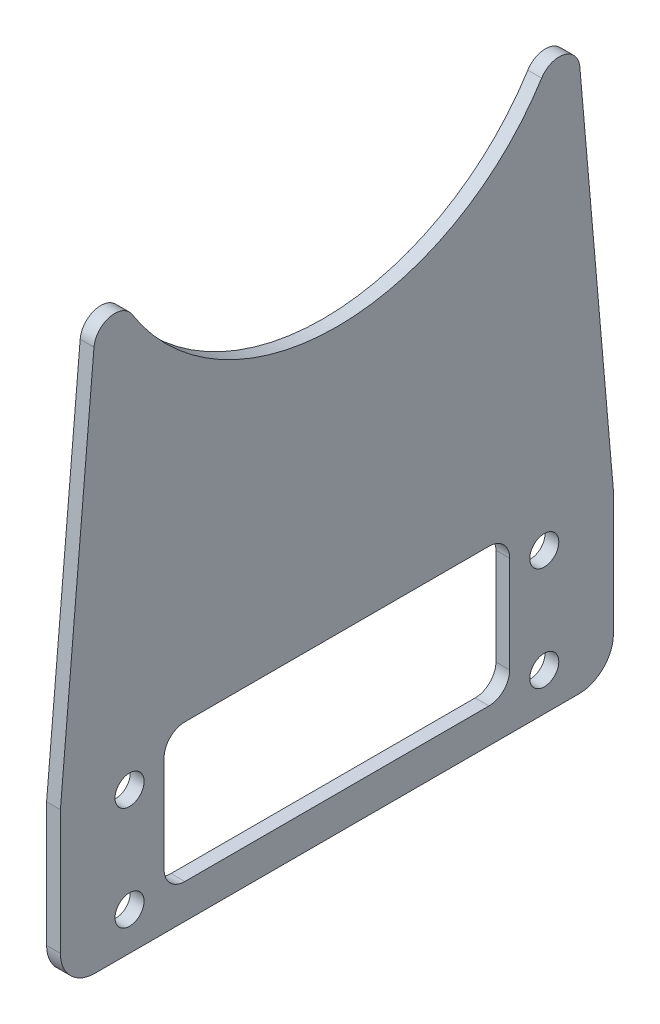
ISO-10303-21;
HEADER;
FILE_DESCRIPTION(('STEP AP214'),'2;1');
FILE_NAME('part.step','',(''),(''),'','','');
FILE_SCHEMA(('AUTOMOTIVE_DESIGN { 1 0 10303 214 1 1 1 1 }'));
ENDSEC;
DATA;
#1=APPLICATION_CONTEXT('core data for automotive mechanical design processes');
#2=APPLICATION_PROTOCOL_DEFINITION('international standard','automotive_design',2000,#1);
#3=PRODUCT_CONTEXT('',#1,'mechanical');
#4=PRODUCT('Part','Part','',(#3));
#5=PRODUCT_RELATED_PRODUCT_CATEGORY('part','',(#4));
#6=PRODUCT_DEFINITION_FORMATION('','',#4);
#7=PRODUCT_DEFINITION_CONTEXT('part definition',#1,'design');
#8=PRODUCT_DEFINITION('design','',#6,#7);
#9=PRODUCT_DEFINITION_SHAPE('','',#8);
#10=(LENGTH_UNIT() NAMED_UNIT(*) SI_UNIT(.MILLI.,.METRE.));
#11=(NAMED_UNIT(*) PLANE_ANGLE_UNIT() SI_UNIT($,.RADIAN.));
#12=(NAMED_UNIT(*) SI_UNIT($,.STERADIAN.) SOLID_ANGLE_UNIT());
#13=UNCERTAINTY_MEASURE_WITH_UNIT(LENGTH_MEASURE(1.E-05),#10,'distance_accuracy_value','');
#14=(GEOMETRIC_REPRESENTATION_CONTEXT(3) GLOBAL_UNCERTAINTY_ASSIGNED_CONTEXT((#13)) GLOBAL_UNIT_ASSIGNED_CONTEXT((#10,
#11,#12)) REPRESENTATION_CONTEXT('',''));
#15=CARTESIAN_POINT('',(0.,0.,0.));
#16=DIRECTION('',(0.,0.,1.));
#17=DIRECTION('',(1.,0.,0.));
#18=AXIS2_PLACEMENT_3D('',#15,#16,#17);
#19=CARTESIAN_POINT('',(2.,11.5,-40.));
#20=DIRECTION('',(0.,0.,1.));
#21=DIRECTION('',(0.,-1.,0.));
#22=AXIS2_PLACEMENT_3D('',#19,#20,#21);
#23=PLANE('',#22);
#24=DIRECTION('',(0.,1.,0.));
#25=VECTOR('',#24,1.);
#26=CARTESIAN_POINT('',(2.,11.5,-40.));
#27=LINE('',#26,#25);
#28=CARTESIAN_POINT('',(2.,-6.5,-40.));
#29=VERTEX_POINT('',#28);
#30=CARTESIAN_POINT('',(2.,11.5,-40.));
#31=VERTEX_POINT('',#30);
#32=EDGE_CURVE('E160',#29,#31,#27,.T.);
#33=ORIENTED_EDGE('',*,*,#32,.F.);
#34=DIRECTION('',(-1.,0.,0.));
#35=VECTOR('',#34,1.);
#36=CARTESIAN_POINT('',(2.,-6.5,-40.));
#37=LINE('',#36,#35);
#38=CARTESIAN_POINT('',(0.,-6.5,-40.));
#39=VERTEX_POINT('',#38);
#40=EDGE_CURVE('E11',#29,#39,#37,.T.);
#41=ORIENTED_EDGE('',*,*,#40,.T.);
#42=DIRECTION('',(0.,1.,0.));
#43=VECTOR('',#42,1.);
#44=CARTESIAN_POINT('',(0.,11.5,-40.));
#45=LINE('',#44,#43);
#46=CARTESIAN_POINT('',(0.,11.5,-40.));
#47=VERTEX_POINT('',#46);
#48=EDGE_CURVE('E180',#39,#47,#45,.T.);
#49=ORIENTED_EDGE('',*,*,#48,.T.);
#50=DIRECTION('',(-1.,0.,0.));
#51=VECTOR('',#50,1.);
#52=CARTESIAN_POINT('',(2.,11.5,-40.));
#53=LINE('',#52,#51);
#54=EDGE_CURVE('E174',#31,#47,#53,.T.);
#55=ORIENTED_EDGE('',*,*,#54,.F.);
#56=EDGE_LOOP('',(#33,#41,#49,#55));
#57=FACE_BOUND('',#56,.T.);
#58=ADVANCED_FACE('F34',(#57),#23,.F.);
#59=CARTESIAN_POINT('',(2.,79.0655702071974,-34.0887785622056));
#60=DIRECTION('',(0.,-0.0871557427476542,0.996194698091746));
#61=DIRECTION('',(0.,-0.996194698091746,-0.0871557427476543));
#62=AXIS2_PLACEMENT_3D('',#59,#60,#61);
#63=PLANE('',#62);
#64=DIRECTION('',(0.,0.996194698091746,0.0871557427476542));
#65=VECTOR('',#64,1.);
#66=CARTESIAN_POINT('',(0.,79.0655702071974,-34.0887785622056));
#67=LINE('',#66,#65);
#68=CARTESIAN_POINT('',(0.,67.0113184520581,-35.1433889380677));
#69=VERTEX_POINT('',#68);
#70=EDGE_CURVE('E278',#47,#69,#67,.T.);
#71=ORIENTED_EDGE('',*,*,#70,.T.);
#72=DIRECTION('',(-1.,0.,0.));
#73=VECTOR('',#72,1.);
#74=CARTESIAN_POINT('',(2.,67.0113184520581,-35.1433889380677));
#75=LINE('',#74,#73);
#76=CARTESIAN_POINT('',(2.,67.0113184520581,-35.1433889380677));
#77=VERTEX_POINT('',#76);
#78=EDGE_CURVE('E176',#69,#77,#75,.F.);
#79=ORIENTED_EDGE('',*,*,#78,.T.);
#80=DIRECTION('',(0.,0.996194698091746,0.0871557427476542));
#81=VECTOR('',#80,1.);
#82=CARTESIAN_POINT('',(2.,79.0655702071974,-34.0887785622056));
#83=LINE('',#82,#81);
#84=EDGE_CURVE('E163',#31,#77,#83,.T.);
#85=ORIENTED_EDGE('',*,*,#84,.F.);
#86=ORIENTED_EDGE('',*,*,#54,.T.);
#87=EDGE_LOOP('',(#71,#79,#85,#86));
#88=FACE_BOUND('',#87,.T.);
#89=ADVANCED_FACE('F173',(#88),#63,.F.);
#90=CARTESIAN_POINT('',(2.,87.,0.));
#91=DIRECTION('',(-1.,0.,0.));
#92=DIRECTION('',(0.,0.,1.));
#93=AXIS2_PLACEMENT_3D('',#90,#91,#92);
#94=CYLINDRICAL_SURFACE('',#93,35.);
#95=CARTESIAN_POINT('',(2.,87.,0.));
#96=DIRECTION('',(-1.,0.,0.));
#97=DIRECTION('',(0.,0.,-1.));
#98=AXIS2_PLACEMENT_3D('',#95,#96,#97);
#99=CIRCLE('',#98,35.);
#100=CARTESIAN_POINT('',(2.,68.3485471798297,-29.6162676192825));
#101=VERTEX_POINT('',#100);
#102=CARTESIAN_POINT('',(2.,68.3485471798297,29.6162676192825));
#103=VERTEX_POINT('',#102);
#104=EDGE_CURVE('E177',#101,#103,#99,.T.);
#105=ORIENTED_EDGE('',*,*,#104,.F.);
#106=DIRECTION('',(-1.,0.,0.));
#107=VECTOR('',#106,1.);
#108=CARTESIAN_POINT('',(2.,68.3485471798297,-29.6162676192825));
#109=LINE('',#108,#107);
#110=CARTESIAN_POINT('',(0.,68.3485471798297,-29.6162676192825));
#111=VERTEX_POINT('',#110);
#112=EDGE_CURVE('E211',#101,#111,#109,.T.);
#113=ORIENTED_EDGE('',*,*,#112,.T.);
#114=CARTESIAN_POINT('',(0.,87.,0.));
#115=DIRECTION('',(-1.,0.,0.));
#116=DIRECTION('',(0.,0.,-1.));
#117=AXIS2_PLACEMENT_3D('',#114,#115,#116);
#118=CIRCLE('',#117,35.);
#119=CARTESIAN_POINT('',(0.,68.3485471798297,29.6162676192825));
#120=VERTEX_POINT('',#119);
#121=EDGE_CURVE('E273',#111,#120,#118,.T.);
#122=ORIENTED_EDGE('',*,*,#121,.T.);
#123=DIRECTION('',(-1.,0.,0.));
#124=VECTOR('',#123,1.);
#125=CARTESIAN_POINT('',(2.,68.3485471798297,29.6162676192825));
#126=LINE('',#125,#124);
#127=EDGE_CURVE('E209',#120,#103,#126,.F.);
#128=ORIENTED_EDGE('',*,*,#127,.T.);
#129=EDGE_LOOP('',(#105,#113,#122,#128));
#130=FACE_BOUND('',#129,.T.);
#131=ADVANCED_FACE('F398',(#130),#94,.F.);
#132=CARTESIAN_POINT('',(2.,11.5,40.));
#133=DIRECTION('',(0.,-0.0871557427476543,-0.996194698091746));
#134=DIRECTION('',(0.,0.996194698091746,-0.0871557427476544));
#135=AXIS2_PLACEMENT_3D('',#132,#133,#134);
#136=PLANE('',#135);
#137=DIRECTION('',(0.,-0.996194698091746,0.0871557427476543));
#138=VECTOR('',#137,1.);
#139=CARTESIAN_POINT('',(2.,11.5,40.));
#140=LINE('',#139,#138);
#141=CARTESIAN_POINT('',(2.,67.0113184520581,35.1433889380677));
#142=VERTEX_POINT('',#141);
#143=CARTESIAN_POINT('',(2.,11.5,40.));
#144=VERTEX_POINT('',#143);
#145=EDGE_CURVE('E283',#142,#144,#140,.T.);
#146=ORIENTED_EDGE('',*,*,#145,.F.);
#147=DIRECTION('',(-1.,0.,0.));
#148=VECTOR('',#147,1.);
#149=CARTESIAN_POINT('',(2.,67.0113184520581,35.1433889380677));
#150=LINE('',#149,#148);
#151=CARTESIAN_POINT('',(0.,67.0113184520581,35.1433889380677));
#152=VERTEX_POINT('',#151);
#153=EDGE_CURVE('E223',#142,#152,#150,.T.);
#154=ORIENTED_EDGE('',*,*,#153,.T.);
#155=DIRECTION('',(0.,-0.996194698091746,0.0871557427476543));
#156=VECTOR('',#155,1.);
#157=CARTESIAN_POINT('',(0.,11.5,40.));
#158=LINE('',#157,#156);
#159=CARTESIAN_POINT('',(0.,11.5,40.));
#160=VERTEX_POINT('',#159);
#161=EDGE_CURVE('E271',#152,#160,#158,.T.);
#162=ORIENTED_EDGE('',*,*,#161,.T.);
#163=DIRECTION('',(-1.,0.,0.));
#164=VECTOR('',#163,1.);
#165=CARTESIAN_POINT('',(2.,11.5,40.));
#166=LINE('',#165,#164);
#167=EDGE_CURVE('E183',#144,#160,#166,.T.);
#168=ORIENTED_EDGE('',*,*,#167,.F.);
#169=EDGE_LOOP('',(#146,#154,#162,#168));
#170=FACE_BOUND('',#169,.T.);
#171=ADVANCED_FACE('F434',(#170),#136,.F.);
#172=CARTESIAN_POINT('',(2.,11.5,40.));
#173=DIRECTION('',(0.,0.,-1.));
#174=DIRECTION('',(0.,1.,0.));
#175=AXIS2_PLACEMENT_3D('',#172,#173,#174);
#176=PLANE('',#175);
#177=DIRECTION('',(0.,-1.,0.));
#178=VECTOR('',#177,1.);
#179=CARTESIAN_POINT('',(0.,11.5,40.));
#180=LINE('',#179,#178);
#181=CARTESIAN_POINT('',(0.,-6.5,40.));
#182=VERTEX_POINT('',#181);
#183=EDGE_CURVE('E268',#160,#182,#180,.T.);
#184=ORIENTED_EDGE('',*,*,#183,.T.);
#185=DIRECTION('',(-1.,0.,0.));
#186=VECTOR('',#185,1.);
#187=CARTESIAN_POINT('',(2.,-6.5,40.));
#188=LINE('',#187,#186);
#189=CARTESIAN_POINT('',(2.,-6.5,40.));
#190=VERTEX_POINT('',#189);
#191=EDGE_CURVE('E57',#182,#190,#188,.F.);
#192=ORIENTED_EDGE('',*,*,#191,.T.);
#193=DIRECTION('',(0.,-1.,0.));
#194=VECTOR('',#193,1.);
#195=CARTESIAN_POINT('',(2.,11.5,40.));
#196=LINE('',#195,#194);
#197=EDGE_CURVE('E254',#144,#190,#196,.T.);
#198=ORIENTED_EDGE('',*,*,#197,.F.);
#199=ORIENTED_EDGE('',*,*,#167,.T.);
#200=EDGE_LOOP('',(#184,#192,#198,#199));
#201=FACE_BOUND('',#200,.T.);
#202=ADVANCED_FACE('F269',(#201),#176,.F.);
#203=CARTESIAN_POINT('',(2.,-11.5,40.));
#204=DIRECTION('',(0.,1.,0.));
#205=DIRECTION('',(0.,0.,1.));
#206=AXIS2_PLACEMENT_3D('',#203,#204,#205);
#207=PLANE('',#206);
#208=DIRECTION('',(0.,0.,-1.));
#209=VECTOR('',#208,1.);
#210=CARTESIAN_POINT('',(2.,-11.5,40.));
#211=LINE('',#210,#209);
#212=CARTESIAN_POINT('',(2.,-11.5,35.));
#213=VERTEX_POINT('',#212);
#214=CARTESIAN_POINT('',(2.,-11.5,-35.));
#215=VERTEX_POINT('',#214);
#216=EDGE_CURVE('E188',#213,#215,#211,.T.);
#217=ORIENTED_EDGE('',*,*,#216,.F.);
#218=DIRECTION('',(-1.,0.,0.));
#219=VECTOR('',#218,1.);
#220=CARTESIAN_POINT('',(2.,-11.5,35.));
#221=LINE('',#220,#219);
#222=CARTESIAN_POINT('',(0.,-11.5,35.));
#223=VERTEX_POINT('',#222);
#224=EDGE_CURVE('E244',#213,#223,#221,.T.);
#225=ORIENTED_EDGE('',*,*,#224,.T.);
#226=DIRECTION('',(0.,0.,-1.));
#227=VECTOR('',#226,1.);
#228=CARTESIAN_POINT('',(0.,-11.5,40.));
#229=LINE('',#228,#227);
#230=CARTESIAN_POINT('',(0.,-11.5,-35.));
#231=VERTEX_POINT('',#230);
#232=EDGE_CURVE('E168',#223,#231,#229,.T.);
#233=ORIENTED_EDGE('',*,*,#232,.T.);
#234=DIRECTION('',(-1.,0.,0.));
#235=VECTOR('',#234,1.);
#236=CARTESIAN_POINT('',(2.,-11.5,-35.));
#237=LINE('',#236,#235);
#238=EDGE_CURVE('E242',#231,#215,#237,.F.);
#239=ORIENTED_EDGE('',*,*,#238,.T.);
#240=EDGE_LOOP('',(#217,#225,#233,#239));
#241=FACE_BOUND('',#240,.T.);
#242=ADVANCED_FACE('F258',(#241),#207,.F.);
#243=CARTESIAN_POINT('',(2.,87.,0.));
#244=DIRECTION('',(1.,0.,0.));
#245=DIRECTION('',(0.,0.,-1.));
#246=AXIS2_PLACEMENT_3D('',#243,#244,#245);
#247=PLANE('',#246);
#248=CARTESIAN_POINT('',(2.,9.,-30.));
#249=DIRECTION('',(1.,0.,0.));
#250=DIRECTION('',(0.,0.,-1.));
#251=AXIS2_PLACEMENT_3D('',#248,#249,#250);
#252=CIRCLE('',#251,2.09999999999999);
#253=CARTESIAN_POINT('',(2.,9.,-32.1));
#254=VERTEX_POINT('',#253);
#255=EDGE_CURVE('E311',#254,#254,#252,.T.);
#256=ORIENTED_EDGE('',*,*,#255,.F.);
#257=EDGE_LOOP('',(#256));
#258=FACE_BOUND('',#257,.T.);
#259=CARTESIAN_POINT('',(2.,-6.,-30.));
#260=DIRECTION('',(1.,0.,0.));
#261=DIRECTION('',(0.,0.,-1.));
#262=AXIS2_PLACEMENT_3D('',#259,#260,#261);
#263=CIRCLE('',#262,2.09999999999998);
#264=CARTESIAN_POINT('',(2.,-6.,-32.1));
#265=VERTEX_POINT('',#264);
#266=EDGE_CURVE('E317',#265,#265,#263,.T.);
#267=ORIENTED_EDGE('',*,*,#266,.F.);
#268=EDGE_LOOP('',(#267));
#269=FACE_BOUND('',#268,.T.);
#270=CARTESIAN_POINT('',(2.,-6.,30.));
#271=DIRECTION('',(1.,0.,0.));
#272=DIRECTION('',(0.,0.,-1.));
#273=AXIS2_PLACEMENT_3D('',#270,#271,#272);
#274=CIRCLE('',#273,2.1);
#275=CARTESIAN_POINT('',(2.,-6.,27.9));
#276=VERTEX_POINT('',#275);
#277=EDGE_CURVE('E323',#276,#276,#274,.T.);
#278=ORIENTED_EDGE('',*,*,#277,.F.);
#279=EDGE_LOOP('',(#278));
#280=FACE_BOUND('',#279,.T.);
#281=CARTESIAN_POINT('',(2.,9.,30.));
#282=DIRECTION('',(1.,0.,0.));
#283=DIRECTION('',(0.,0.,-1.));
#284=AXIS2_PLACEMENT_3D('',#281,#282,#283);
#285=CIRCLE('',#284,2.1);
#286=CARTESIAN_POINT('',(2.,9.,27.9));
#287=VERTEX_POINT('',#286);
#288=EDGE_CURVE('E329',#287,#287,#285,.T.);
#289=ORIENTED_EDGE('',*,*,#288,.F.);
#290=EDGE_LOOP('',(#289));
#291=FACE_BOUND('',#290,.T.);
#292=DIRECTION('',(0.,1.,0.));
#293=VECTOR('',#292,1.);
#294=CARTESIAN_POINT('',(2.,13.5,-25.));
#295=LINE('',#294,#293);
#296=CARTESIAN_POINT('',(2.,-3.5,-25.));
#297=VERTEX_POINT('',#296);
#298=CARTESIAN_POINT('',(2.,10.5,-25.));
#299=VERTEX_POINT('',#298);
#300=EDGE_CURVE('E297',#297,#299,#295,.T.);
#301=ORIENTED_EDGE('',*,*,#300,.F.);
#302=CARTESIAN_POINT('',(2.,-3.5,-22.));
#303=DIRECTION('',(1.,0.,0.));
#304=DIRECTION('',(0.,0.,-1.));
#305=AXIS2_PLACEMENT_3D('',#302,#303,#304);
#306=CIRCLE('',#305,3.);
#307=CARTESIAN_POINT('',(2.,-6.5,-22.));
#308=VERTEX_POINT('',#307);
#309=EDGE_CURVE('E234',#297,#308,#306,.F.);
#310=ORIENTED_EDGE('',*,*,#309,.T.);
#311=DIRECTION('',(0.,0.,-1.));
#312=VECTOR('',#311,1.);
#313=CARTESIAN_POINT('',(2.,-6.5,25.));
#314=LINE('',#313,#312);
#315=CARTESIAN_POINT('',(2.,-6.5,22.));
#316=VERTEX_POINT('',#315);
#317=EDGE_CURVE('E287',#316,#308,#314,.T.);
#318=ORIENTED_EDGE('',*,*,#317,.F.);
#319=CARTESIAN_POINT('',(2.,-3.5,22.));
#320=DIRECTION('',(1.,0.,0.));
#321=DIRECTION('',(0.,0.,-1.));
#322=AXIS2_PLACEMENT_3D('',#319,#320,#321);
#323=CIRCLE('',#322,3.);
#324=CARTESIAN_POINT('',(2.,-3.5,25.));
#325=VERTEX_POINT('',#324);
#326=EDGE_CURVE('E226',#316,#325,#323,.F.);
#327=ORIENTED_EDGE('',*,*,#326,.T.);
#328=DIRECTION('',(0.,-1.,0.));
#329=VECTOR('',#328,1.);
#330=CARTESIAN_POINT('',(2.,13.5,25.));
#331=LINE('',#330,#329);
#332=CARTESIAN_POINT('',(2.,10.5,25.));
#333=VERTEX_POINT('',#332);
#334=EDGE_CURVE('E291',#333,#325,#331,.T.);
#335=ORIENTED_EDGE('',*,*,#334,.F.);
#336=CARTESIAN_POINT('',(2.,10.5,22.));
#337=DIRECTION('',(1.,0.,0.));
#338=DIRECTION('',(0.,0.,-1.));
#339=AXIS2_PLACEMENT_3D('',#336,#337,#338);
#340=CIRCLE('',#339,3.);
#341=CARTESIAN_POINT('',(2.,13.5,22.));
#342=VERTEX_POINT('',#341);
#343=EDGE_CURVE('E238',#333,#342,#340,.F.);
#344=ORIENTED_EDGE('',*,*,#343,.T.);
#345=DIRECTION('',(0.,0.,1.));
#346=VECTOR('',#345,1.);
#347=CARTESIAN_POINT('',(2.,13.5,25.));
#348=LINE('',#347,#346);
#349=CARTESIAN_POINT('',(2.,13.5,-22.));
#350=VERTEX_POINT('',#349);
#351=EDGE_CURVE('E294',#350,#342,#348,.T.);
#352=ORIENTED_EDGE('',*,*,#351,.F.);
#353=CARTESIAN_POINT('',(2.,10.5,-22.));
#354=DIRECTION('',(1.,0.,0.));
#355=DIRECTION('',(0.,0.,-1.));
#356=AXIS2_PLACEMENT_3D('',#353,#354,#355);
#357=CIRCLE('',#356,3.);
#358=EDGE_CURVE('E230',#350,#299,#357,.F.);
#359=ORIENTED_EDGE('',*,*,#358,.T.);
#360=EDGE_LOOP('',(#301,#310,#318,#327,#335,#344,#352,#359));
#361=FACE_BOUND('',#360,.T.);
#362=ORIENTED_EDGE('',*,*,#197,.T.);
#363=CARTESIAN_POINT('',(2.,-6.5,35.));
#364=DIRECTION('',(1.,0.,0.));
#365=DIRECTION('',(0.,0.,-1.));
#366=AXIS2_PLACEMENT_3D('',#363,#364,#365);
#367=CIRCLE('',#366,5.);
#368=EDGE_CURVE('E42',#190,#213,#367,.T.);
#369=ORIENTED_EDGE('',*,*,#368,.T.);
#370=ORIENTED_EDGE('',*,*,#216,.T.);
#371=CARTESIAN_POINT('',(2.,-6.5,-35.));
#372=DIRECTION('',(1.,0.,0.));
#373=DIRECTION('',(0.,0.,-1.));
#374=AXIS2_PLACEMENT_3D('',#371,#372,#373);
#375=CIRCLE('',#374,5.);
#376=EDGE_CURVE('E49',#215,#29,#375,.T.);
#377=ORIENTED_EDGE('',*,*,#376,.T.);
#378=ORIENTED_EDGE('',*,*,#32,.T.);
#379=ORIENTED_EDGE('',*,*,#84,.T.);
#380=CARTESIAN_POINT('',(2.,66.7498512238151,-32.1548048437924));
#381=DIRECTION('',(1.,0.,0.));
#382=DIRECTION('',(0.,0.,-1.));
#383=AXIS2_PLACEMENT_3D('',#380,#381,#382);
#384=CIRCLE('',#383,3.);
#385=EDGE_CURVE('E221',#77,#101,#384,.T.);
#386=ORIENTED_EDGE('',*,*,#385,.T.);
#387=ORIENTED_EDGE('',*,*,#104,.T.);
#388=CARTESIAN_POINT('',(2.,66.7498512238151,32.1548048437924));
#389=DIRECTION('',(1.,0.,0.));
#390=DIRECTION('',(0.,0.,-1.));
#391=AXIS2_PLACEMENT_3D('',#388,#389,#390);
#392=CIRCLE('',#391,3.);
#393=EDGE_CURVE('E219',#103,#142,#392,.T.);
#394=ORIENTED_EDGE('',*,*,#393,.T.);
#395=ORIENTED_EDGE('',*,*,#145,.T.);
#396=EDGE_LOOP('',(#362,#369,#370,#377,#378,#379,#386,#387,#394,#395));
#397=FACE_BOUND('',#396,.T.);
#398=ADVANCED_FACE('F162',(#258,#269,#280,#291,#361,#397),#247,.T.);
#399=CARTESIAN_POINT('',(0.,87.,0.));
#400=DIRECTION('',(1.,0.,0.));
#401=DIRECTION('',(0.,0.,-1.));
#402=AXIS2_PLACEMENT_3D('',#399,#400,#401);
#403=PLANE('',#402);
#404=CARTESIAN_POINT('',(0.,9.,-30.));
#405=DIRECTION('',(1.,0.,0.));
#406=DIRECTION('',(0.,0.,-1.));
#407=AXIS2_PLACEMENT_3D('',#404,#405,#406);
#408=CIRCLE('',#407,2.09999999999999);
#409=CARTESIAN_POINT('',(0.,9.,-32.1));
#410=VERTEX_POINT('',#409);
#411=EDGE_CURVE('E314',#410,#410,#408,.T.);
#412=ORIENTED_EDGE('',*,*,#411,.T.);
#413=EDGE_LOOP('',(#412));
#414=FACE_BOUND('',#413,.T.);
#415=CARTESIAN_POINT('',(0.,-6.,-30.));
#416=DIRECTION('',(1.,0.,0.));
#417=DIRECTION('',(0.,0.,-1.));
#418=AXIS2_PLACEMENT_3D('',#415,#416,#417);
#419=CIRCLE('',#418,2.09999999999998);
#420=CARTESIAN_POINT('',(0.,-6.,-32.1));
#421=VERTEX_POINT('',#420);
#422=EDGE_CURVE('E320',#421,#421,#419,.T.);
#423=ORIENTED_EDGE('',*,*,#422,.T.);
#424=EDGE_LOOP('',(#423));
#425=FACE_BOUND('',#424,.T.);
#426=CARTESIAN_POINT('',(0.,-6.,30.));
#427=DIRECTION('',(1.,0.,0.));
#428=DIRECTION('',(0.,0.,-1.));
#429=AXIS2_PLACEMENT_3D('',#426,#427,#428);
#430=CIRCLE('',#429,2.1);
#431=CARTESIAN_POINT('',(0.,-6.,27.9));
#432=VERTEX_POINT('',#431);
#433=EDGE_CURVE('E326',#432,#432,#430,.T.);
#434=ORIENTED_EDGE('',*,*,#433,.T.);
#435=EDGE_LOOP('',(#434));
#436=FACE_BOUND('',#435,.T.);
#437=CARTESIAN_POINT('',(0.,9.,30.));
#438=DIRECTION('',(1.,0.,0.));
#439=DIRECTION('',(0.,0.,-1.));
#440=AXIS2_PLACEMENT_3D('',#437,#438,#439);
#441=CIRCLE('',#440,2.1);
#442=CARTESIAN_POINT('',(0.,9.,27.9));
#443=VERTEX_POINT('',#442);
#444=EDGE_CURVE('E300',#443,#443,#441,.T.);
#445=ORIENTED_EDGE('',*,*,#444,.T.);
#446=EDGE_LOOP('',(#445));
#447=FACE_BOUND('',#446,.T.);
#448=DIRECTION('',(0.,-1.,0.));
#449=VECTOR('',#448,1.);
#450=CARTESIAN_POINT('',(0.,13.5,25.));
#451=LINE('',#450,#449);
#452=CARTESIAN_POINT('',(0.,10.5,25.));
#453=VERTEX_POINT('',#452);
#454=CARTESIAN_POINT('',(0.,-3.5,25.));
#455=VERTEX_POINT('',#454);
#456=EDGE_CURVE('E303',#453,#455,#451,.T.);
#457=ORIENTED_EDGE('',*,*,#456,.T.);
#458=CARTESIAN_POINT('',(0.,-3.5,22.));
#459=DIRECTION('',(1.,0.,0.));
#460=DIRECTION('',(0.,0.,-1.));
#461=AXIS2_PLACEMENT_3D('',#458,#459,#460);
#462=CIRCLE('',#461,3.);
#463=CARTESIAN_POINT('',(0.,-6.5,22.));
#464=VERTEX_POINT('',#463);
#465=EDGE_CURVE('E228',#455,#464,#462,.T.);
#466=ORIENTED_EDGE('',*,*,#465,.T.);
#467=DIRECTION('',(0.,0.,-1.));
#468=VECTOR('',#467,1.);
#469=CARTESIAN_POINT('',(0.,-6.5,25.));
#470=LINE('',#469,#468);
#471=CARTESIAN_POINT('',(0.,-6.5,-22.));
#472=VERTEX_POINT('',#471);
#473=EDGE_CURVE('E280',#464,#472,#470,.T.);
#474=ORIENTED_EDGE('',*,*,#473,.T.);
#475=CARTESIAN_POINT('',(0.,-3.5,-22.));
#476=DIRECTION('',(1.,0.,0.));
#477=DIRECTION('',(0.,0.,-1.));
#478=AXIS2_PLACEMENT_3D('',#475,#476,#477);
#479=CIRCLE('',#478,3.);
#480=CARTESIAN_POINT('',(0.,-3.5,-25.));
#481=VERTEX_POINT('',#480);
#482=EDGE_CURVE('E236',#472,#481,#479,.T.);
#483=ORIENTED_EDGE('',*,*,#482,.T.);
#484=DIRECTION('',(0.,1.,0.));
#485=VECTOR('',#484,1.);
#486=CARTESIAN_POINT('',(0.,13.5,-25.));
#487=LINE('',#486,#485);
#488=CARTESIAN_POINT('',(0.,10.5,-25.));
#489=VERTEX_POINT('',#488);
#490=EDGE_CURVE('E290',#481,#489,#487,.T.);
#491=ORIENTED_EDGE('',*,*,#490,.T.);
#492=CARTESIAN_POINT('',(0.,10.5,-22.));
#493=DIRECTION('',(1.,0.,0.));
#494=DIRECTION('',(0.,0.,-1.));
#495=AXIS2_PLACEMENT_3D('',#492,#493,#494);
#496=CIRCLE('',#495,3.);
#497=CARTESIAN_POINT('',(0.,13.5,-22.));
#498=VERTEX_POINT('',#497);
#499=EDGE_CURVE('E232',#489,#498,#496,.T.);
#500=ORIENTED_EDGE('',*,*,#499,.T.);
#501=DIRECTION('',(0.,0.,1.));
#502=VECTOR('',#501,1.);
#503=CARTESIAN_POINT('',(0.,13.5,25.));
#504=LINE('',#503,#502);
#505=CARTESIAN_POINT('',(0.,13.5,22.));
#506=VERTEX_POINT('',#505);
#507=EDGE_CURVE('E306',#498,#506,#504,.T.);
#508=ORIENTED_EDGE('',*,*,#507,.T.);
#509=CARTESIAN_POINT('',(0.,10.5,22.));
#510=DIRECTION('',(1.,0.,0.));
#511=DIRECTION('',(0.,0.,-1.));
#512=AXIS2_PLACEMENT_3D('',#509,#510,#511);
#513=CIRCLE('',#512,3.);
#514=EDGE_CURVE('E240',#506,#453,#513,.T.);
#515=ORIENTED_EDGE('',*,*,#514,.T.);
#516=EDGE_LOOP('',(#457,#466,#474,#483,#491,#500,#508,#515));
#517=FACE_BOUND('',#516,.T.);
#518=ORIENTED_EDGE('',*,*,#232,.F.);
#519=CARTESIAN_POINT('',(0.,-6.5,35.));
#520=DIRECTION('',(1.,0.,0.));
#521=DIRECTION('',(0.,0.,-1.));
#522=AXIS2_PLACEMENT_3D('',#519,#520,#521);
#523=CIRCLE('',#522,5.);
#524=EDGE_CURVE('E249',#223,#182,#523,.F.);
#525=ORIENTED_EDGE('',*,*,#524,.T.);
#526=ORIENTED_EDGE('',*,*,#183,.F.);
#527=ORIENTED_EDGE('',*,*,#161,.F.);
#528=CARTESIAN_POINT('',(0.,66.7498512238151,32.1548048437924));
#529=DIRECTION('',(1.,0.,0.));
#530=DIRECTION('',(0.,0.,-1.));
#531=AXIS2_PLACEMENT_3D('',#528,#529,#530);
#532=CIRCLE('',#531,3.);
#533=EDGE_CURVE('E214',#152,#120,#532,.F.);
#534=ORIENTED_EDGE('',*,*,#533,.T.);
#535=ORIENTED_EDGE('',*,*,#121,.F.);
#536=CARTESIAN_POINT('',(0.,66.7498512238151,-32.1548048437924));
#537=DIRECTION('',(1.,0.,0.));
#538=DIRECTION('',(0.,0.,-1.));
#539=AXIS2_PLACEMENT_3D('',#536,#537,#538);
#540=CIRCLE('',#539,3.);
#541=EDGE_CURVE('E216',#111,#69,#540,.F.);
#542=ORIENTED_EDGE('',*,*,#541,.T.);
#543=ORIENTED_EDGE('',*,*,#70,.F.);
#544=ORIENTED_EDGE('',*,*,#48,.F.);
#545=CARTESIAN_POINT('',(0.,-6.5,-35.));
#546=DIRECTION('',(1.,0.,0.));
#547=DIRECTION('',(0.,0.,-1.));
#548=AXIS2_PLACEMENT_3D('',#545,#546,#547);
#549=CIRCLE('',#548,5.);
#550=EDGE_CURVE('E247',#39,#231,#549,.F.);
#551=ORIENTED_EDGE('',*,*,#550,.T.);
#552=EDGE_LOOP('',(#518,#525,#526,#527,#534,#535,#542,#543,#544,#551));
#553=FACE_BOUND('',#552,.T.);
#554=ADVANCED_FACE('F266',(#414,#425,#436,#447,#517,#553),#403,.F.);
#555=CARTESIAN_POINT('',(0.,13.5,-25.));
#556=DIRECTION('',(0.,0.,-1.));
#557=DIRECTION('',(-1.,0.,0.));
#558=AXIS2_PLACEMENT_3D('',#555,#556,#557);
#559=PLANE('',#558);
#560=ORIENTED_EDGE('',*,*,#300,.T.);
#561=DIRECTION('',(1.,0.,0.));
#562=VECTOR('',#561,1.);
#563=CARTESIAN_POINT('',(0.,10.5,-25.));
#564=LINE('',#563,#562);
#565=EDGE_CURVE('E207',#299,#489,#564,.F.);
#566=ORIENTED_EDGE('',*,*,#565,.T.);
#567=ORIENTED_EDGE('',*,*,#490,.F.);
#568=DIRECTION('',(1.,0.,0.));
#569=VECTOR('',#568,1.);
#570=CARTESIAN_POINT('',(2.,-3.5,-25.));
#571=LINE('',#570,#569);
#572=EDGE_CURVE('E204',#481,#297,#571,.T.);
#573=ORIENTED_EDGE('',*,*,#572,.T.);
#574=EDGE_LOOP('',(#560,#566,#567,#573));
#575=FACE_BOUND('',#574,.T.);
#576=ADVANCED_FACE('F354',(#575),#559,.F.);
#577=CARTESIAN_POINT('',(0.,-6.5,25.));
#578=DIRECTION('',(0.,-1.,0.));
#579=DIRECTION('',(0.,0.,-1.));
#580=AXIS2_PLACEMENT_3D('',#577,#578,#579);
#581=PLANE('',#580);
#582=ORIENTED_EDGE('',*,*,#473,.F.);
#583=DIRECTION('',(1.,0.,0.));
#584=VECTOR('',#583,1.);
#585=CARTESIAN_POINT('',(2.,-6.5,22.));
#586=LINE('',#585,#584);
#587=EDGE_CURVE('E185',#464,#316,#586,.T.);
#588=ORIENTED_EDGE('',*,*,#587,.T.);
#589=ORIENTED_EDGE('',*,*,#317,.T.);
#590=DIRECTION('',(1.,0.,0.));
#591=VECTOR('',#590,1.);
#592=CARTESIAN_POINT('',(0.,-6.5,-22.));
#593=LINE('',#592,#591);
#594=EDGE_CURVE('E182',#308,#472,#593,.F.);
#595=ORIENTED_EDGE('',*,*,#594,.T.);
#596=EDGE_LOOP('',(#582,#588,#589,#595));
#597=FACE_BOUND('',#596,.T.);
#598=ADVANCED_FACE('F380',(#597),#581,.F.);
#599=CARTESIAN_POINT('',(0.,13.5,25.));
#600=DIRECTION('',(0.,0.,1.));
#601=DIRECTION('',(1.,0.,0.));
#602=AXIS2_PLACEMENT_3D('',#599,#600,#601);
#603=PLANE('',#602);
#604=ORIENTED_EDGE('',*,*,#334,.T.);
#605=DIRECTION('',(1.,0.,0.));
#606=VECTOR('',#605,1.);
#607=CARTESIAN_POINT('',(0.,-3.5,25.));
#608=LINE('',#607,#606);
#609=EDGE_CURVE('E197',#325,#455,#608,.F.);
#610=ORIENTED_EDGE('',*,*,#609,.T.);
#611=ORIENTED_EDGE('',*,*,#456,.F.);
#612=DIRECTION('',(1.,0.,0.));
#613=VECTOR('',#612,1.);
#614=CARTESIAN_POINT('',(2.,10.5,25.));
#615=LINE('',#614,#613);
#616=EDGE_CURVE('E194',#453,#333,#615,.T.);
#617=ORIENTED_EDGE('',*,*,#616,.T.);
#618=EDGE_LOOP('',(#604,#610,#611,#617));
#619=FACE_BOUND('',#618,.T.);
#620=ADVANCED_FACE('F371',(#619),#603,.F.);
#621=CARTESIAN_POINT('',(0.,13.5,25.));
#622=DIRECTION('',(0.,1.,0.));
#623=DIRECTION('',(0.,0.,1.));
#624=AXIS2_PLACEMENT_3D('',#621,#622,#623);
#625=PLANE('',#624);
#626=ORIENTED_EDGE('',*,*,#507,.F.);
#627=DIRECTION('',(1.,0.,0.));
#628=VECTOR('',#627,1.);
#629=CARTESIAN_POINT('',(2.,13.5,-22.));
#630=LINE('',#629,#628);
#631=EDGE_CURVE('E201',#498,#350,#630,.T.);
#632=ORIENTED_EDGE('',*,*,#631,.T.);
#633=ORIENTED_EDGE('',*,*,#351,.T.);
#634=DIRECTION('',(1.,0.,0.));
#635=VECTOR('',#634,1.);
#636=CARTESIAN_POINT('',(0.,13.5,22.));
#637=LINE('',#636,#635);
#638=EDGE_CURVE('E199',#342,#506,#637,.F.);
#639=ORIENTED_EDGE('',*,*,#638,.T.);
#640=EDGE_LOOP('',(#626,#632,#633,#639));
#641=FACE_BOUND('',#640,.T.);
#642=ADVANCED_FACE('F341',(#641),#625,.F.);
#643=CARTESIAN_POINT('',(0.,9.,30.));
#644=DIRECTION('',(1.,0.,0.));
#645=DIRECTION('',(0.,0.,-1.));
#646=AXIS2_PLACEMENT_3D('',#643,#644,#645);
#647=CYLINDRICAL_SURFACE('',#646,2.1);
#648=ORIENTED_EDGE('',*,*,#444,.F.);
#649=EDGE_LOOP('',(#648));
#650=FACE_BOUND('',#649,.T.);
#651=ORIENTED_EDGE('',*,*,#288,.T.);
#652=EDGE_LOOP('',(#651));
#653=FACE_BOUND('',#652,.T.);
#654=ADVANCED_FACE('F337',(#650,#653),#647,.F.);
#655=CARTESIAN_POINT('',(0.,-6.,30.));
#656=DIRECTION('',(1.,0.,0.));
#657=DIRECTION('',(0.,0.,-1.));
#658=AXIS2_PLACEMENT_3D('',#655,#656,#657);
#659=CYLINDRICAL_SURFACE('',#658,2.1);
#660=ORIENTED_EDGE('',*,*,#433,.F.);
#661=EDGE_LOOP('',(#660));
#662=FACE_BOUND('',#661,.T.);
#663=ORIENTED_EDGE('',*,*,#277,.T.);
#664=EDGE_LOOP('',(#663));
#665=FACE_BOUND('',#664,.T.);
#666=ADVANCED_FACE('F340',(#662,#665),#659,.F.);
#667=CARTESIAN_POINT('',(0.,-6.,-30.));
#668=DIRECTION('',(1.,0.,0.));
#669=DIRECTION('',(0.,0.,-1.));
#670=AXIS2_PLACEMENT_3D('',#667,#668,#669);
#671=CYLINDRICAL_SURFACE('',#670,2.09999999999998);
#672=ORIENTED_EDGE('',*,*,#422,.F.);
#673=EDGE_LOOP('',(#672));
#674=FACE_BOUND('',#673,.T.);
#675=ORIENTED_EDGE('',*,*,#266,.T.);
#676=EDGE_LOOP('',(#675));
#677=FACE_BOUND('',#676,.T.);
#678=ADVANCED_FACE('F407',(#674,#677),#671,.F.);
#679=CARTESIAN_POINT('',(0.,9.,-30.));
#680=DIRECTION('',(1.,0.,0.));
#681=DIRECTION('',(0.,0.,-1.));
#682=AXIS2_PLACEMENT_3D('',#679,#680,#681);
#683=CYLINDRICAL_SURFACE('',#682,2.09999999999999);
#684=ORIENTED_EDGE('',*,*,#411,.F.);
#685=EDGE_LOOP('',(#684));
#686=FACE_BOUND('',#685,.T.);
#687=ORIENTED_EDGE('',*,*,#255,.T.);
#688=EDGE_LOOP('',(#687));
#689=FACE_BOUND('',#688,.T.);
#690=ADVANCED_FACE('F403',(#686,#689),#683,.F.);
#691=CARTESIAN_POINT('',(0.,-3.5,22.));
#692=DIRECTION('',(-1.,0.,0.));
#693=DIRECTION('',(0.,0.,1.));
#694=AXIS2_PLACEMENT_3D('',#691,#692,#693);
#695=CYLINDRICAL_SURFACE('',#694,3.);
#696=ORIENTED_EDGE('',*,*,#465,.F.);
#697=ORIENTED_EDGE('',*,*,#609,.F.);
#698=ORIENTED_EDGE('',*,*,#326,.F.);
#699=ORIENTED_EDGE('',*,*,#587,.F.);
#700=EDGE_LOOP('',(#696,#697,#698,#699));
#701=FACE_BOUND('',#700,.T.);
#702=ADVANCED_FACE('F375',(#701),#695,.F.);
#703=CARTESIAN_POINT('',(0.,10.5,-22.));
#704=DIRECTION('',(-1.,0.,0.));
#705=DIRECTION('',(0.,0.,1.));
#706=AXIS2_PLACEMENT_3D('',#703,#704,#705);
#707=CYLINDRICAL_SURFACE('',#706,3.);
#708=ORIENTED_EDGE('',*,*,#499,.F.);
#709=ORIENTED_EDGE('',*,*,#565,.F.);
#710=ORIENTED_EDGE('',*,*,#358,.F.);
#711=ORIENTED_EDGE('',*,*,#631,.F.);
#712=EDGE_LOOP('',(#708,#709,#710,#711));
#713=FACE_BOUND('',#712,.T.);
#714=ADVANCED_FACE('F359',(#713),#707,.F.);
#715=CARTESIAN_POINT('',(0.,-3.5,-22.));
#716=DIRECTION('',(-1.,0.,0.));
#717=DIRECTION('',(0.,0.,1.));
#718=AXIS2_PLACEMENT_3D('',#715,#716,#717);
#719=CYLINDRICAL_SURFACE('',#718,3.);
#720=ORIENTED_EDGE('',*,*,#482,.F.);
#721=ORIENTED_EDGE('',*,*,#594,.F.);
#722=ORIENTED_EDGE('',*,*,#309,.F.);
#723=ORIENTED_EDGE('',*,*,#572,.F.);
#724=EDGE_LOOP('',(#720,#721,#722,#723));
#725=FACE_BOUND('',#724,.T.);
#726=ADVANCED_FACE('F383',(#725),#719,.F.);
#727=CARTESIAN_POINT('',(0.,10.5,22.));
#728=DIRECTION('',(-1.,0.,0.));
#729=DIRECTION('',(0.,0.,1.));
#730=AXIS2_PLACEMENT_3D('',#727,#728,#729);
#731=CYLINDRICAL_SURFACE('',#730,3.);
#732=ORIENTED_EDGE('',*,*,#514,.F.);
#733=ORIENTED_EDGE('',*,*,#638,.F.);
#734=ORIENTED_EDGE('',*,*,#343,.F.);
#735=ORIENTED_EDGE('',*,*,#616,.F.);
#736=EDGE_LOOP('',(#732,#733,#734,#735));
#737=FACE_BOUND('',#736,.T.);
#738=ADVANCED_FACE('F366',(#737),#731,.F.);
#739=CARTESIAN_POINT('',(2.,66.7498512238151,-32.1548048437924));
#740=DIRECTION('',(-1.,0.,0.));
#741=DIRECTION('',(0.,0.,1.));
#742=AXIS2_PLACEMENT_3D('',#739,#740,#741);
#743=CYLINDRICAL_SURFACE('',#742,3.);
#744=ORIENTED_EDGE('',*,*,#385,.F.);
#745=ORIENTED_EDGE('',*,*,#78,.F.);
#746=ORIENTED_EDGE('',*,*,#541,.F.);
#747=ORIENTED_EDGE('',*,*,#112,.F.);
#748=EDGE_LOOP('',(#744,#745,#746,#747));
#749=FACE_BOUND('',#748,.T.);
#750=ADVANCED_FACE('F390',(#749),#743,.T.);
#751=CARTESIAN_POINT('',(2.,66.7498512238151,32.1548048437924));
#752=DIRECTION('',(-1.,0.,0.));
#753=DIRECTION('',(0.,0.,1.));
#754=AXIS2_PLACEMENT_3D('',#751,#752,#753);
#755=CYLINDRICAL_SURFACE('',#754,3.);
#756=ORIENTED_EDGE('',*,*,#393,.F.);
#757=ORIENTED_EDGE('',*,*,#127,.F.);
#758=ORIENTED_EDGE('',*,*,#533,.F.);
#759=ORIENTED_EDGE('',*,*,#153,.F.);
#760=EDGE_LOOP('',(#756,#757,#758,#759));
#761=FACE_BOUND('',#760,.T.);
#762=ADVANCED_FACE('F448',(#761),#755,.T.);
#763=CARTESIAN_POINT('',(2.,-6.5,35.));
#764=DIRECTION('',(-1.,0.,0.));
#765=DIRECTION('',(0.,0.,1.));
#766=AXIS2_PLACEMENT_3D('',#763,#764,#765);
#767=CYLINDRICAL_SURFACE('',#766,5.);
#768=ORIENTED_EDGE('',*,*,#368,.F.);
#769=ORIENTED_EDGE('',*,*,#191,.F.);
#770=ORIENTED_EDGE('',*,*,#524,.F.);
#771=ORIENTED_EDGE('',*,*,#224,.F.);
#772=EDGE_LOOP('',(#768,#769,#770,#771));
#773=FACE_BOUND('',#772,.T.);
#774=ADVANCED_FACE('F263',(#773),#767,.T.);
#775=CARTESIAN_POINT('',(2.,-6.5,-35.));
#776=DIRECTION('',(-1.,0.,0.));
#777=DIRECTION('',(0.,0.,1.));
#778=AXIS2_PLACEMENT_3D('',#775,#776,#777);
#779=CYLINDRICAL_SURFACE('',#778,5.);
#780=ORIENTED_EDGE('',*,*,#376,.F.);
#781=ORIENTED_EDGE('',*,*,#238,.F.);
#782=ORIENTED_EDGE('',*,*,#550,.F.);
#783=ORIENTED_EDGE('',*,*,#40,.F.);
#784=EDGE_LOOP('',(#780,#781,#782,#783));
#785=FACE_BOUND('',#784,.T.);
#786=ADVANCED_FACE('F36',(#785),#779,.T.);
#787=CLOSED_SHELL('',(#58,#89,#131,#171,#202,#242,#398,#554,#576,#598,#620,#642,#654,#666,#678,
#690,#702,#714,#726,#738,#750,#762,#774,#786));
#788=MANIFOLD_SOLID_BREP('B2',#787);
#789=ADVANCED_BREP_SHAPE_REPRESENTATION('',(#18,#788),#14);
#790=SHAPE_DEFINITION_REPRESENTATION(#9,#789);
ENDSEC;
END-ISO-10303-21;
